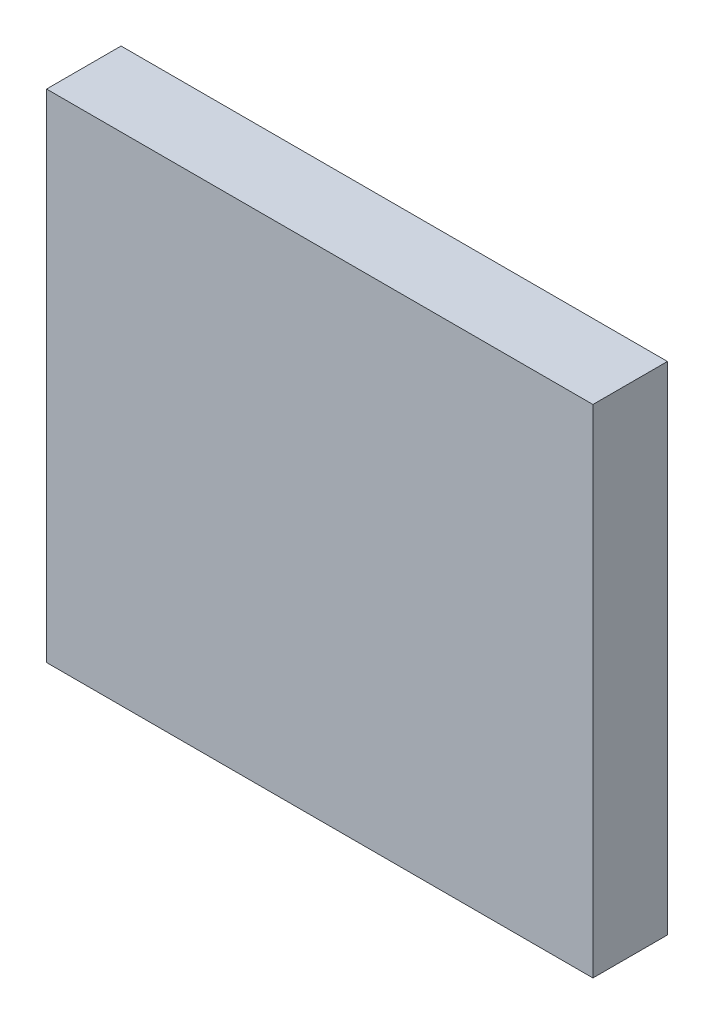
ISO-10303-21;
HEADER;
FILE_DESCRIPTION(('STEP AP214'),'2;1');
FILE_NAME('part.step','',(''),(''),'','','');
FILE_SCHEMA(('AUTOMOTIVE_DESIGN { 1 0 10303 214 1 1 1 1 }'));
ENDSEC;
DATA;
#1=APPLICATION_CONTEXT('core data for automotive mechanical design processes');
#2=APPLICATION_PROTOCOL_DEFINITION('international standard','automotive_design',2000,#1);
#3=PRODUCT_CONTEXT('',#1,'mechanical');
#4=PRODUCT('Part','Part','',(#3));
#5=PRODUCT_RELATED_PRODUCT_CATEGORY('part','',(#4));
#6=PRODUCT_DEFINITION_FORMATION('','',#4);
#7=PRODUCT_DEFINITION_CONTEXT('part definition',#1,'design');
#8=PRODUCT_DEFINITION('design','',#6,#7);
#9=PRODUCT_DEFINITION_SHAPE('','',#8);
#10=(LENGTH_UNIT() NAMED_UNIT(*) SI_UNIT(.MILLI.,.METRE.));
#11=(NAMED_UNIT(*) PLANE_ANGLE_UNIT() SI_UNIT($,.RADIAN.));
#12=(NAMED_UNIT(*) SI_UNIT($,.STERADIAN.) SOLID_ANGLE_UNIT());
#13=UNCERTAINTY_MEASURE_WITH_UNIT(LENGTH_MEASURE(1.E-05),#10,'distance_accuracy_value','');
#14=(GEOMETRIC_REPRESENTATION_CONTEXT(3) GLOBAL_UNCERTAINTY_ASSIGNED_CONTEXT((#13)) GLOBAL_UNIT_ASSIGNED_CONTEXT((#10,
#11,#12)) REPRESENTATION_CONTEXT('',''));
#15=CARTESIAN_POINT('',(0.,0.,0.));
#16=DIRECTION('',(0.,0.,1.));
#17=DIRECTION('',(1.,0.,0.));
#18=AXIS2_PLACEMENT_3D('',#15,#16,#17);
#19=CARTESIAN_POINT('',(0.,0.,11.25));
#20=DIRECTION('',(1.,0.,0.));
#21=DIRECTION('',(0.,0.,-1.));
#22=AXIS2_PLACEMENT_3D('',#19,#20,#21);
#23=PLANE('',#22);
#24=DIRECTION('',(0.,-1.,0.));
#25=VECTOR('',#24,1.);
#26=CARTESIAN_POINT('',(0.,0.,0.));
#27=LINE('',#26,#25);
#28=CARTESIAN_POINT('',(0.,75.,0.));
#29=VERTEX_POINT('',#28);
#30=CARTESIAN_POINT('',(0.,0.,0.));
#31=VERTEX_POINT('',#30);
#32=EDGE_CURVE('E145',#29,#31,#27,.T.);
#33=ORIENTED_EDGE('',*,*,#32,.T.);
#34=DIRECTION('',(0.,0.,-1.));
#35=VECTOR('',#34,1.);
#36=CARTESIAN_POINT('',(0.,0.,11.25));
#37=LINE('',#36,#35);
#38=CARTESIAN_POINT('',(0.,0.,11.25));
#39=VERTEX_POINT('',#38);
#40=EDGE_CURVE('E11',#39,#31,#37,.T.);
#41=ORIENTED_EDGE('',*,*,#40,.F.);
#42=DIRECTION('',(0.,-1.,0.));
#43=VECTOR('',#42,1.);
#44=CARTESIAN_POINT('',(0.,0.,11.25));
#45=LINE('',#44,#43);
#46=CARTESIAN_POINT('',(0.,75.,11.25));
#47=VERTEX_POINT('',#46);
#48=EDGE_CURVE('E149',#47,#39,#45,.T.);
#49=ORIENTED_EDGE('',*,*,#48,.F.);
#50=DIRECTION('',(0.,0.,-1.));
#51=VECTOR('',#50,1.);
#52=CARTESIAN_POINT('',(0.,75.,11.25));
#53=LINE('',#52,#51);
#54=EDGE_CURVE('E155',#47,#29,#53,.T.);
#55=ORIENTED_EDGE('',*,*,#54,.T.);
#56=EDGE_LOOP('',(#33,#41,#49,#55));
#57=FACE_BOUND('',#56,.T.);
#58=ADVANCED_FACE('F37',(#57),#23,.F.);
#59=CARTESIAN_POINT('',(0.,0.,11.25));
#60=DIRECTION('',(0.,1.,0.));
#61=DIRECTION('',(0.,0.,1.));
#62=AXIS2_PLACEMENT_3D('',#59,#60,#61);
#63=PLANE('',#62);
#64=DIRECTION('',(1.,0.,0.));
#65=VECTOR('',#64,1.);
#66=CARTESIAN_POINT('',(0.,0.,0.));
#67=LINE('',#66,#65);
#68=CARTESIAN_POINT('',(82.5,0.,0.));
#69=VERTEX_POINT('',#68);
#70=EDGE_CURVE('E158',#31,#69,#67,.T.);
#71=ORIENTED_EDGE('',*,*,#70,.T.);
#72=DIRECTION('',(0.,0.,-1.));
#73=VECTOR('',#72,1.);
#74=CARTESIAN_POINT('',(82.5,0.,11.25));
#75=LINE('',#74,#73);
#76=CARTESIAN_POINT('',(82.5,0.,11.25));
#77=VERTEX_POINT('',#76);
#78=EDGE_CURVE('E44',#77,#69,#75,.T.);
#79=ORIENTED_EDGE('',*,*,#78,.F.);
#80=DIRECTION('',(1.,0.,0.));
#81=VECTOR('',#80,1.);
#82=CARTESIAN_POINT('',(0.,0.,11.25));
#83=LINE('',#82,#81);
#84=EDGE_CURVE('E88',#39,#77,#83,.T.);
#85=ORIENTED_EDGE('',*,*,#84,.F.);
#86=ORIENTED_EDGE('',*,*,#40,.T.);
#87=EDGE_LOOP('',(#71,#79,#85,#86));
#88=FACE_BOUND('',#87,.T.);
#89=ADVANCED_FACE('F186',(#88),#63,.F.);
#90=CARTESIAN_POINT('',(82.5,0.,11.25));
#91=DIRECTION('',(-1.,0.,0.));
#92=DIRECTION('',(0.,0.,1.));
#93=AXIS2_PLACEMENT_3D('',#90,#91,#92);
#94=PLANE('',#93);
#95=DIRECTION('',(0.,1.,0.));
#96=VECTOR('',#95,1.);
#97=CARTESIAN_POINT('',(82.5,0.,0.));
#98=LINE('',#97,#96);
#99=CARTESIAN_POINT('',(82.5,75.,0.));
#100=VERTEX_POINT('',#99);
#101=EDGE_CURVE('E160',#69,#100,#98,.T.);
#102=ORIENTED_EDGE('',*,*,#101,.T.);
#103=DIRECTION('',(0.,0.,-1.));
#104=VECTOR('',#103,1.);
#105=CARTESIAN_POINT('',(82.5,75.,11.25));
#106=LINE('',#105,#104);
#107=CARTESIAN_POINT('',(82.5,75.,11.25));
#108=VERTEX_POINT('',#107);
#109=EDGE_CURVE('E164',#108,#100,#106,.T.);
#110=ORIENTED_EDGE('',*,*,#109,.F.);
#111=DIRECTION('',(0.,1.,0.));
#112=VECTOR('',#111,1.);
#113=CARTESIAN_POINT('',(82.5,0.,11.25));
#114=LINE('',#113,#112);
#115=EDGE_CURVE('E152',#77,#108,#114,.T.);
#116=ORIENTED_EDGE('',*,*,#115,.F.);
#117=ORIENTED_EDGE('',*,*,#78,.T.);
#118=EDGE_LOOP('',(#102,#110,#116,#117));
#119=FACE_BOUND('',#118,.T.);
#120=ADVANCED_FACE('F169',(#119),#94,.F.);
#121=CARTESIAN_POINT('',(0.,75.,11.25));
#122=DIRECTION('',(0.,-1.,0.));
#123=DIRECTION('',(0.,0.,-1.));
#124=AXIS2_PLACEMENT_3D('',#121,#122,#123);
#125=PLANE('',#124);
#126=DIRECTION('',(-1.,0.,0.));
#127=VECTOR('',#126,1.);
#128=CARTESIAN_POINT('',(0.,75.,0.));
#129=LINE('',#128,#127);
#130=EDGE_CURVE('E81',#100,#29,#129,.T.);
#131=ORIENTED_EDGE('',*,*,#130,.T.);
#132=ORIENTED_EDGE('',*,*,#54,.F.);
#133=DIRECTION('',(-1.,0.,0.));
#134=VECTOR('',#133,1.);
#135=CARTESIAN_POINT('',(0.,75.,11.25));
#136=LINE('',#135,#134);
#137=EDGE_CURVE('E60',#108,#47,#136,.T.);
#138=ORIENTED_EDGE('',*,*,#137,.F.);
#139=ORIENTED_EDGE('',*,*,#109,.T.);
#140=EDGE_LOOP('',(#131,#132,#138,#139));
#141=FACE_BOUND('',#140,.T.);
#142=ADVANCED_FACE('F177',(#141),#125,.F.);
#143=CARTESIAN_POINT('',(0.,0.,11.25));
#144=DIRECTION('',(0.,0.,-1.));
#145=DIRECTION('',(-1.,0.,0.));
#146=AXIS2_PLACEMENT_3D('',#143,#144,#145);
#147=PLANE('',#146);
#148=ORIENTED_EDGE('',*,*,#48,.T.);
#149=ORIENTED_EDGE('',*,*,#84,.T.);
#150=ORIENTED_EDGE('',*,*,#115,.T.);
#151=ORIENTED_EDGE('',*,*,#137,.T.);
#152=EDGE_LOOP('',(#148,#149,#150,#151));
#153=FACE_BOUND('',#152,.T.);
#154=ADVANCED_FACE('F179',(#153),#147,.F.);
#155=CARTESIAN_POINT('',(0.,0.,0.));
#156=DIRECTION('',(0.,0.,-1.));
#157=DIRECTION('',(-1.,0.,0.));
#158=AXIS2_PLACEMENT_3D('',#155,#156,#157);
#159=PLANE('',#158);
#160=DIRECTION('',(0.,-1.,0.));
#161=VECTOR('',#160,1.);
#162=CARTESIAN_POINT('',(79.5,72.,0.));
#163=LINE('',#162,#161);
#164=CARTESIAN_POINT('',(79.5,72.,0.));
#165=VERTEX_POINT('',#164);
#166=CARTESIAN_POINT('',(79.5,3.,0.));
#167=VERTEX_POINT('',#166);
#168=EDGE_CURVE('E51',#165,#167,#163,.T.);
#169=ORIENTED_EDGE('',*,*,#168,.F.);
#170=DIRECTION('',(1.,0.,0.));
#171=VECTOR('',#170,1.);
#172=CARTESIAN_POINT('',(79.5,72.,0.));
#173=LINE('',#172,#171);
#174=CARTESIAN_POINT('',(3.,72.,0.));
#175=VERTEX_POINT('',#174);
#176=EDGE_CURVE('E130',#175,#165,#173,.T.);
#177=ORIENTED_EDGE('',*,*,#176,.F.);
#178=DIRECTION('',(0.,1.,0.));
#179=VECTOR('',#178,1.);
#180=CARTESIAN_POINT('',(3.,72.,0.));
#181=LINE('',#180,#179);
#182=CARTESIAN_POINT('',(2.99999999999999,3.,0.));
#183=VERTEX_POINT('',#182);
#184=EDGE_CURVE('E133',#183,#175,#181,.T.);
#185=ORIENTED_EDGE('',*,*,#184,.F.);
#186=DIRECTION('',(-1.,0.,0.));
#187=VECTOR('',#186,1.);
#188=CARTESIAN_POINT('',(79.5,3.,0.));
#189=LINE('',#188,#187);
#190=EDGE_CURVE('E139',#167,#183,#189,.T.);
#191=ORIENTED_EDGE('',*,*,#190,.F.);
#192=EDGE_LOOP('',(#169,#177,#185,#191));
#193=FACE_BOUND('',#192,.T.);
#194=ORIENTED_EDGE('',*,*,#32,.F.);
#195=ORIENTED_EDGE('',*,*,#130,.F.);
#196=ORIENTED_EDGE('',*,*,#101,.F.);
#197=ORIENTED_EDGE('',*,*,#70,.F.);
#198=EDGE_LOOP('',(#194,#195,#196,#197));
#199=FACE_BOUND('',#198,.T.);
#200=ADVANCED_FACE('F173',(#193,#199),#159,.T.);
#201=CARTESIAN_POINT('',(79.5,72.,9.25));
#202=DIRECTION('',(1.,0.,0.));
#203=DIRECTION('',(0.,1.,0.));
#204=AXIS2_PLACEMENT_3D('',#201,#202,#203);
#205=PLANE('',#204);
#206=ORIENTED_EDGE('',*,*,#168,.T.);
#207=DIRECTION('',(0.,0.,-1.));
#208=VECTOR('',#207,1.);
#209=CARTESIAN_POINT('',(79.5,3.,9.25));
#210=LINE('',#209,#208);
#211=CARTESIAN_POINT('',(79.5,3.,9.25));
#212=VERTEX_POINT('',#211);
#213=EDGE_CURVE('E108',#212,#167,#210,.T.);
#214=ORIENTED_EDGE('',*,*,#213,.F.);
#215=DIRECTION('',(0.,-1.,0.));
#216=VECTOR('',#215,1.);
#217=CARTESIAN_POINT('',(79.5,72.,9.25));
#218=LINE('',#217,#216);
#219=CARTESIAN_POINT('',(79.5,72.,9.25));
#220=VERTEX_POINT('',#219);
#221=EDGE_CURVE('E112',#220,#212,#218,.T.);
#222=ORIENTED_EDGE('',*,*,#221,.F.);
#223=DIRECTION('',(0.,0.,-1.));
#224=VECTOR('',#223,1.);
#225=CARTESIAN_POINT('',(79.5,72.,9.25));
#226=LINE('',#225,#224);
#227=EDGE_CURVE('E143',#220,#165,#226,.T.);
#228=ORIENTED_EDGE('',*,*,#227,.T.);
#229=EDGE_LOOP('',(#206,#214,#222,#228));
#230=FACE_BOUND('',#229,.T.);
#231=ADVANCED_FACE('F110',(#230),#205,.F.);
#232=CARTESIAN_POINT('',(79.5,72.,9.25));
#233=DIRECTION('',(0.,1.,0.));
#234=DIRECTION('',(0.,0.,1.));
#235=AXIS2_PLACEMENT_3D('',#232,#233,#234);
#236=PLANE('',#235);
#237=ORIENTED_EDGE('',*,*,#176,.T.);
#238=ORIENTED_EDGE('',*,*,#227,.F.);
#239=DIRECTION('',(1.,0.,0.));
#240=VECTOR('',#239,1.);
#241=CARTESIAN_POINT('',(79.5,72.,9.25));
#242=LINE('',#241,#240);
#243=CARTESIAN_POINT('',(3.,72.,9.25));
#244=VERTEX_POINT('',#243);
#245=EDGE_CURVE('E118',#244,#220,#242,.T.);
#246=ORIENTED_EDGE('',*,*,#245,.F.);
#247=DIRECTION('',(0.,0.,-1.));
#248=VECTOR('',#247,1.);
#249=CARTESIAN_POINT('',(3.,72.,9.25));
#250=LINE('',#249,#248);
#251=EDGE_CURVE('E146',#244,#175,#250,.T.);
#252=ORIENTED_EDGE('',*,*,#251,.T.);
#253=EDGE_LOOP('',(#237,#238,#246,#252));
#254=FACE_BOUND('',#253,.T.);
#255=ADVANCED_FACE('F230',(#254),#236,.F.);
#256=CARTESIAN_POINT('',(3.,72.,9.25));
#257=DIRECTION('',(-1.,0.,0.));
#258=DIRECTION('',(0.,-1.,0.));
#259=AXIS2_PLACEMENT_3D('',#256,#257,#258);
#260=PLANE('',#259);
#261=ORIENTED_EDGE('',*,*,#184,.T.);
#262=ORIENTED_EDGE('',*,*,#251,.F.);
#263=DIRECTION('',(0.,1.,0.));
#264=VECTOR('',#263,1.);
#265=CARTESIAN_POINT('',(3.,72.,9.25));
#266=LINE('',#265,#264);
#267=CARTESIAN_POINT('',(2.99999999999999,3.,9.25));
#268=VERTEX_POINT('',#267);
#269=EDGE_CURVE('E126',#268,#244,#266,.T.);
#270=ORIENTED_EDGE('',*,*,#269,.F.);
#271=DIRECTION('',(0.,0.,-1.));
#272=VECTOR('',#271,1.);
#273=CARTESIAN_POINT('',(2.99999999999999,3.,9.25));
#274=LINE('',#273,#272);
#275=EDGE_CURVE('E117',#268,#183,#274,.T.);
#276=ORIENTED_EDGE('',*,*,#275,.T.);
#277=EDGE_LOOP('',(#261,#262,#270,#276));
#278=FACE_BOUND('',#277,.T.);
#279=ADVANCED_FACE('F240',(#278),#260,.F.);
#280=CARTESIAN_POINT('',(79.5,3.,9.25));
#281=DIRECTION('',(0.,-1.,0.));
#282=DIRECTION('',(0.,0.,-1.));
#283=AXIS2_PLACEMENT_3D('',#280,#281,#282);
#284=PLANE('',#283);
#285=ORIENTED_EDGE('',*,*,#190,.T.);
#286=ORIENTED_EDGE('',*,*,#275,.F.);
#287=DIRECTION('',(-1.,0.,0.));
#288=VECTOR('',#287,1.);
#289=CARTESIAN_POINT('',(79.5,3.,9.25));
#290=LINE('',#289,#288);
#291=EDGE_CURVE('E121',#212,#268,#290,.T.);
#292=ORIENTED_EDGE('',*,*,#291,.F.);
#293=ORIENTED_EDGE('',*,*,#213,.T.);
#294=EDGE_LOOP('',(#285,#286,#292,#293));
#295=FACE_BOUND('',#294,.T.);
#296=ADVANCED_FACE('F122',(#295),#284,.F.);
#297=CARTESIAN_POINT('',(0.,0.,9.25));
#298=DIRECTION('',(0.,0.,-1.));
#299=DIRECTION('',(-1.,0.,0.));
#300=AXIS2_PLACEMENT_3D('',#297,#298,#299);
#301=PLANE('',#300);
#302=ORIENTED_EDGE('',*,*,#221,.T.);
#303=ORIENTED_EDGE('',*,*,#291,.T.);
#304=ORIENTED_EDGE('',*,*,#269,.T.);
#305=ORIENTED_EDGE('',*,*,#245,.T.);
#306=EDGE_LOOP('',(#302,#303,#304,#305));
#307=FACE_BOUND('',#306,.T.);
#308=ADVANCED_FACE('F128',(#307),#301,.T.);
#309=CLOSED_SHELL('',(#58,#89,#120,#142,#154,#200,#231,#255,#279,#296,#308));
#310=MANIFOLD_SOLID_BREP('B2',#309);
#311=ADVANCED_BREP_SHAPE_REPRESENTATION('',(#18,#310),#14);
#312=SHAPE_DEFINITION_REPRESENTATION(#9,#311);
ENDSEC;
END-ISO-10303-21;
